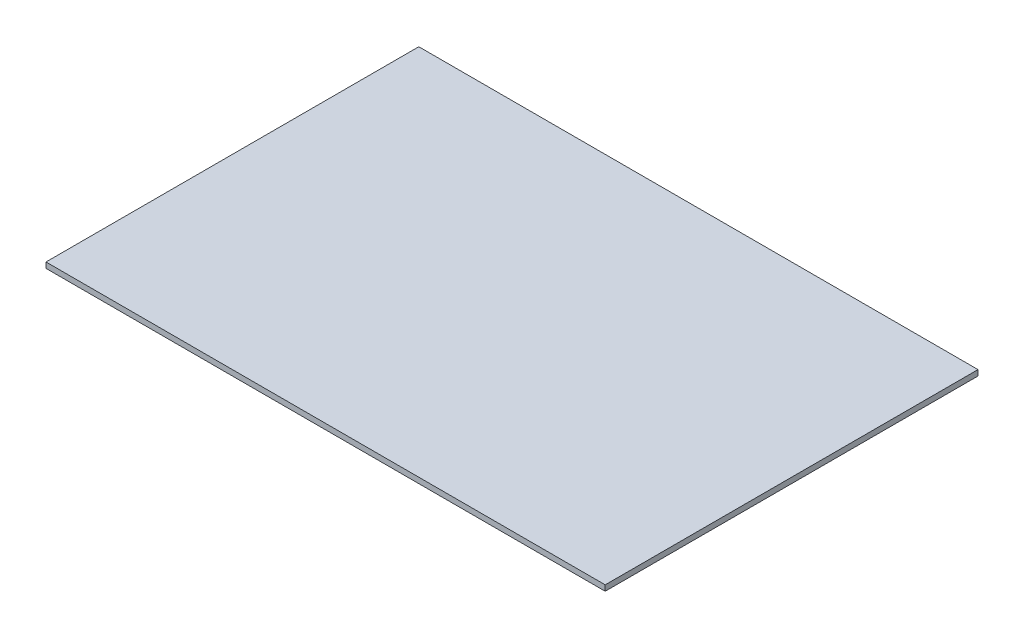
ISO-10303-21;
HEADER;
FILE_DESCRIPTION(('STEP AP214'),'2;1');
FILE_NAME('part.step','',(''),(''),'','','');
FILE_SCHEMA(('AUTOMOTIVE_DESIGN { 1 0 10303 214 1 1 1 1 }'));
ENDSEC;
DATA;
#1=APPLICATION_CONTEXT('core data for automotive mechanical design processes');
#2=APPLICATION_PROTOCOL_DEFINITION('international standard','automotive_design',2000,#1);
#3=PRODUCT_CONTEXT('',#1,'mechanical');
#4=PRODUCT('Part','Part','',(#3));
#5=PRODUCT_RELATED_PRODUCT_CATEGORY('part','',(#4));
#6=PRODUCT_DEFINITION_FORMATION('','',#4);
#7=PRODUCT_DEFINITION_CONTEXT('part definition',#1,'design');
#8=PRODUCT_DEFINITION('design','',#6,#7);
#9=PRODUCT_DEFINITION_SHAPE('','',#8);
#10=(LENGTH_UNIT() NAMED_UNIT(*) SI_UNIT(.MILLI.,.METRE.));
#11=(NAMED_UNIT(*) PLANE_ANGLE_UNIT() SI_UNIT($,.RADIAN.));
#12=(NAMED_UNIT(*) SI_UNIT($,.STERADIAN.) SOLID_ANGLE_UNIT());
#13=UNCERTAINTY_MEASURE_WITH_UNIT(LENGTH_MEASURE(1.E-05),#10,'distance_accuracy_value','');
#14=(GEOMETRIC_REPRESENTATION_CONTEXT(3) GLOBAL_UNCERTAINTY_ASSIGNED_CONTEXT((#13)) GLOBAL_UNIT_ASSIGNED_CONTEXT((#10,
#11,#12)) REPRESENTATION_CONTEXT('',''));
#15=CARTESIAN_POINT('',(0.,0.,0.));
#16=DIRECTION('',(0.,0.,1.));
#17=DIRECTION('',(1.,0.,0.));
#18=AXIS2_PLACEMENT_3D('',#15,#16,#17);
#19=CARTESIAN_POINT('',(150.,3.,-100.));
#20=DIRECTION('',(-1.,0.,0.));
#21=DIRECTION('',(0.,0.,1.));
#22=AXIS2_PLACEMENT_3D('',#19,#20,#21);
#23=PLANE('',#22);
#24=DIRECTION('',(0.,0.,-1.));
#25=VECTOR('',#24,1.);
#26=CARTESIAN_POINT('',(150.,0.,-100.));
#27=LINE('',#26,#25);
#28=CARTESIAN_POINT('',(150.,0.,100.));
#29=VERTEX_POINT('',#28);
#30=CARTESIAN_POINT('',(150.,0.,-100.));
#31=VERTEX_POINT('',#30);
#32=EDGE_CURVE('E107',#29,#31,#27,.T.);
#33=ORIENTED_EDGE('',*,*,#32,.T.);
#34=DIRECTION('',(0.,-1.,0.));
#35=VECTOR('',#34,1.);
#36=CARTESIAN_POINT('',(150.,3.,-100.));
#37=LINE('',#36,#35);
#38=CARTESIAN_POINT('',(150.,3.,-100.));
#39=VERTEX_POINT('',#38);
#40=EDGE_CURVE('E11',#39,#31,#37,.T.);
#41=ORIENTED_EDGE('',*,*,#40,.F.);
#42=DIRECTION('',(0.,0.,-1.));
#43=VECTOR('',#42,1.);
#44=CARTESIAN_POINT('',(150.,3.,-100.));
#45=LINE('',#44,#43);
#46=CARTESIAN_POINT('',(150.,3.,100.));
#47=VERTEX_POINT('',#46);
#48=EDGE_CURVE('E91',#47,#39,#45,.T.);
#49=ORIENTED_EDGE('',*,*,#48,.F.);
#50=DIRECTION('',(0.,-1.,0.));
#51=VECTOR('',#50,1.);
#52=CARTESIAN_POINT('',(150.,3.,100.));
#53=LINE('',#52,#51);
#54=EDGE_CURVE('E103',#47,#29,#53,.T.);
#55=ORIENTED_EDGE('',*,*,#54,.T.);
#56=EDGE_LOOP('',(#33,#41,#49,#55));
#57=FACE_BOUND('',#56,.T.);
#58=ADVANCED_FACE('F39',(#57),#23,.F.);
#59=CARTESIAN_POINT('',(-150.,3.,-100.));
#60=DIRECTION('',(0.,0.,1.));
#61=DIRECTION('',(1.,0.,0.));
#62=AXIS2_PLACEMENT_3D('',#59,#60,#61);
#63=PLANE('',#62);
#64=DIRECTION('',(-1.,0.,0.));
#65=VECTOR('',#64,1.);
#66=CARTESIAN_POINT('',(-150.,0.,-100.));
#67=LINE('',#66,#65);
#68=CARTESIAN_POINT('',(-150.,0.,-100.));
#69=VERTEX_POINT('',#68);
#70=EDGE_CURVE('E96',#31,#69,#67,.T.);
#71=ORIENTED_EDGE('',*,*,#70,.T.);
#72=DIRECTION('',(0.,-1.,0.));
#73=VECTOR('',#72,1.);
#74=CARTESIAN_POINT('',(-150.,3.,-100.));
#75=LINE('',#74,#73);
#76=CARTESIAN_POINT('',(-150.,3.,-100.));
#77=VERTEX_POINT('',#76);
#78=EDGE_CURVE('E48',#77,#69,#75,.T.);
#79=ORIENTED_EDGE('',*,*,#78,.F.);
#80=DIRECTION('',(-1.,0.,0.));
#81=VECTOR('',#80,1.);
#82=CARTESIAN_POINT('',(-150.,3.,-100.));
#83=LINE('',#82,#81);
#84=EDGE_CURVE('E86',#39,#77,#83,.T.);
#85=ORIENTED_EDGE('',*,*,#84,.F.);
#86=ORIENTED_EDGE('',*,*,#40,.T.);
#87=EDGE_LOOP('',(#71,#79,#85,#86));
#88=FACE_BOUND('',#87,.T.);
#89=ADVANCED_FACE('F95',(#88),#63,.F.);
#90=CARTESIAN_POINT('',(-150.,3.,-100.));
#91=DIRECTION('',(1.,0.,0.));
#92=DIRECTION('',(0.,0.,-1.));
#93=AXIS2_PLACEMENT_3D('',#90,#91,#92);
#94=PLANE('',#93);
#95=DIRECTION('',(0.,0.,1.));
#96=VECTOR('',#95,1.);
#97=CARTESIAN_POINT('',(-150.,0.,-100.));
#98=LINE('',#97,#96);
#99=CARTESIAN_POINT('',(-150.,0.,100.));
#100=VERTEX_POINT('',#99);
#101=EDGE_CURVE('E73',#69,#100,#98,.T.);
#102=ORIENTED_EDGE('',*,*,#101,.T.);
#103=DIRECTION('',(0.,-1.,0.));
#104=VECTOR('',#103,1.);
#105=CARTESIAN_POINT('',(-150.,3.,100.));
#106=LINE('',#105,#104);
#107=CARTESIAN_POINT('',(-150.,3.,100.));
#108=VERTEX_POINT('',#107);
#109=EDGE_CURVE('E98',#108,#100,#106,.T.);
#110=ORIENTED_EDGE('',*,*,#109,.F.);
#111=DIRECTION('',(0.,0.,1.));
#112=VECTOR('',#111,1.);
#113=CARTESIAN_POINT('',(-150.,3.,-100.));
#114=LINE('',#113,#112);
#115=EDGE_CURVE('E89',#77,#108,#114,.T.);
#116=ORIENTED_EDGE('',*,*,#115,.F.);
#117=ORIENTED_EDGE('',*,*,#78,.T.);
#118=EDGE_LOOP('',(#102,#110,#116,#117));
#119=FACE_BOUND('',#118,.T.);
#120=ADVANCED_FACE('F99',(#119),#94,.F.);
#121=CARTESIAN_POINT('',(-150.,3.,100.));
#122=DIRECTION('',(0.,0.,-1.));
#123=DIRECTION('',(-1.,0.,0.));
#124=AXIS2_PLACEMENT_3D('',#121,#122,#123);
#125=PLANE('',#124);
#126=DIRECTION('',(1.,0.,0.));
#127=VECTOR('',#126,1.);
#128=CARTESIAN_POINT('',(-150.,0.,100.));
#129=LINE('',#128,#127);
#130=EDGE_CURVE('E79',#100,#29,#129,.T.);
#131=ORIENTED_EDGE('',*,*,#130,.T.);
#132=ORIENTED_EDGE('',*,*,#54,.F.);
#133=DIRECTION('',(1.,0.,0.));
#134=VECTOR('',#133,1.);
#135=CARTESIAN_POINT('',(-150.,3.,100.));
#136=LINE('',#135,#134);
#137=EDGE_CURVE('E56',#108,#47,#136,.T.);
#138=ORIENTED_EDGE('',*,*,#137,.F.);
#139=ORIENTED_EDGE('',*,*,#109,.T.);
#140=EDGE_LOOP('',(#131,#132,#138,#139));
#141=FACE_BOUND('',#140,.T.);
#142=ADVANCED_FACE('F120',(#141),#125,.F.);
#143=CARTESIAN_POINT('',(0.,3.,0.));
#144=DIRECTION('',(0.,1.,0.));
#145=DIRECTION('',(0.,0.,1.));
#146=AXIS2_PLACEMENT_3D('',#143,#144,#145);
#147=PLANE('',#146);
#148=ORIENTED_EDGE('',*,*,#48,.T.);
#149=ORIENTED_EDGE('',*,*,#84,.T.);
#150=ORIENTED_EDGE('',*,*,#115,.T.);
#151=ORIENTED_EDGE('',*,*,#137,.T.);
#152=EDGE_LOOP('',(#148,#149,#150,#151));
#153=FACE_BOUND('',#152,.T.);
#154=ADVANCED_FACE('F87',(#153),#147,.T.);
#155=CARTESIAN_POINT('',(0.,0.,0.));
#156=DIRECTION('',(0.,1.,0.));
#157=DIRECTION('',(0.,0.,1.));
#158=AXIS2_PLACEMENT_3D('',#155,#156,#157);
#159=PLANE('',#158);
#160=ORIENTED_EDGE('',*,*,#32,.F.);
#161=ORIENTED_EDGE('',*,*,#130,.F.);
#162=ORIENTED_EDGE('',*,*,#101,.F.);
#163=ORIENTED_EDGE('',*,*,#70,.F.);
#164=EDGE_LOOP('',(#160,#161,#162,#163));
#165=FACE_BOUND('',#164,.T.);
#166=ADVANCED_FACE('F123',(#165),#159,.F.);
#167=CLOSED_SHELL('',(#58,#89,#120,#142,#154,#166));
#168=MANIFOLD_SOLID_BREP('B2',#167);
#169=ADVANCED_BREP_SHAPE_REPRESENTATION('',(#18,#168),#14);
#170=SHAPE_DEFINITION_REPRESENTATION(#9,#169);
ENDSEC;
END-ISO-10303-21;
